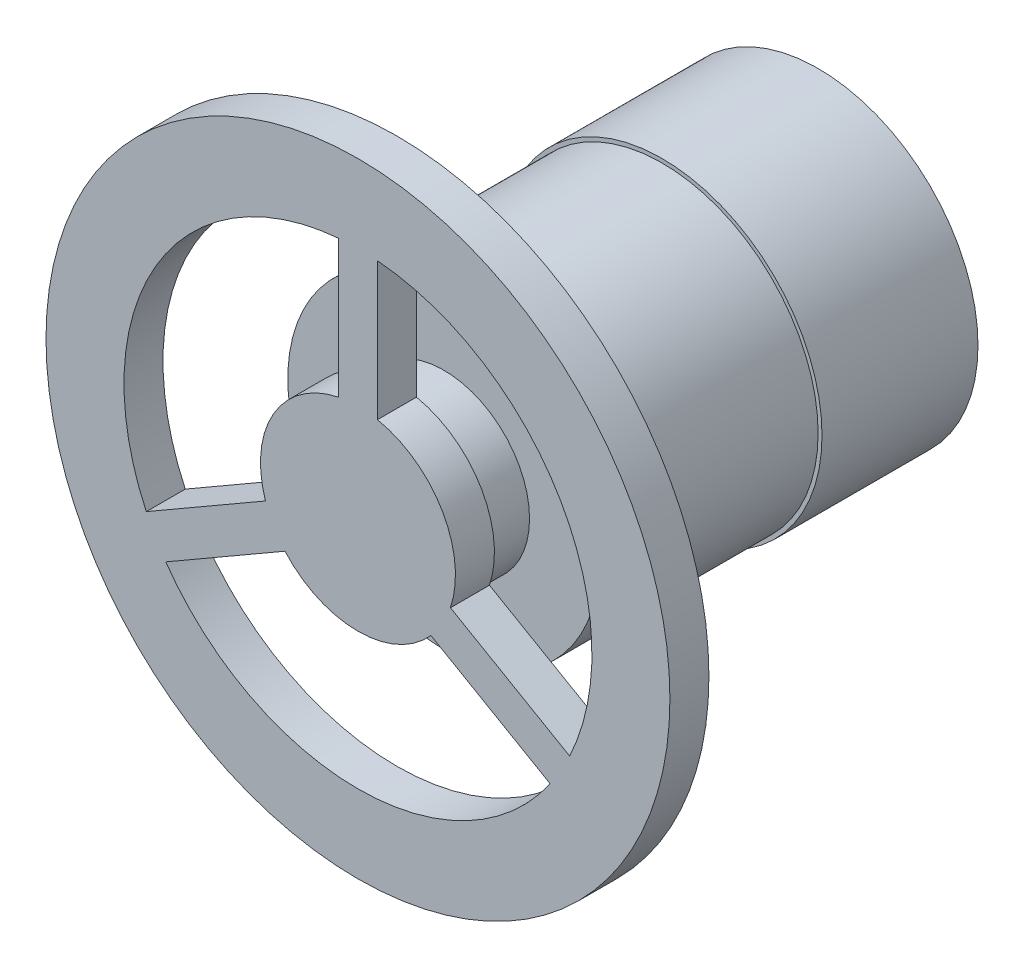
ISO-10303-21;
HEADER;
FILE_DESCRIPTION(('STEP AP214'),'2;1');
FILE_NAME('part.step','',(''),(''),'','','');
FILE_SCHEMA(('AUTOMOTIVE_DESIGN { 1 0 10303 214 1 1 1 1 }'));
ENDSEC;
DATA;
#1=APPLICATION_CONTEXT('core data for automotive mechanical design processes');
#2=APPLICATION_PROTOCOL_DEFINITION('international standard','automotive_design',2000,#1);
#3=PRODUCT_CONTEXT('',#1,'mechanical');
#4=PRODUCT('Part','Part','',(#3));
#5=PRODUCT_RELATED_PRODUCT_CATEGORY('part','',(#4));
#6=PRODUCT_DEFINITION_FORMATION('','',#4);
#7=PRODUCT_DEFINITION_CONTEXT('part definition',#1,'design');
#8=PRODUCT_DEFINITION('design','',#6,#7);
#9=PRODUCT_DEFINITION_SHAPE('','',#8);
#10=(LENGTH_UNIT() NAMED_UNIT(*) SI_UNIT(.MILLI.,.METRE.));
#11=(NAMED_UNIT(*) PLANE_ANGLE_UNIT() SI_UNIT($,.RADIAN.));
#12=(NAMED_UNIT(*) SI_UNIT($,.STERADIAN.) SOLID_ANGLE_UNIT());
#13=UNCERTAINTY_MEASURE_WITH_UNIT(LENGTH_MEASURE(1.E-05),#10,'distance_accuracy_value','');
#14=(GEOMETRIC_REPRESENTATION_CONTEXT(3) GLOBAL_UNCERTAINTY_ASSIGNED_CONTEXT((#13)) GLOBAL_UNIT_ASSIGNED_CONTEXT((#10,
#11,#12)) REPRESENTATION_CONTEXT('',''));
#15=CARTESIAN_POINT('',(0.,0.,0.));
#16=DIRECTION('',(0.,0.,1.));
#17=DIRECTION('',(1.,0.,0.));
#18=AXIS2_PLACEMENT_3D('',#15,#16,#17);
#19=CARTESIAN_POINT('',(0.,0.,20.));
#20=DIRECTION('',(0.,0.,-1.));
#21=DIRECTION('',(-1.,0.,0.));
#22=AXIS2_PLACEMENT_3D('',#19,#20,#21);
#23=CYLINDRICAL_SURFACE('',#22,20.5);
#24=CARTESIAN_POINT('',(0.,0.,20.));
#25=DIRECTION('',(0.,0.,1.));
#26=DIRECTION('',(1.,0.,0.));
#27=AXIS2_PLACEMENT_3D('',#24,#25,#26);
#28=CIRCLE('',#27,20.5);
#29=CARTESIAN_POINT('',(20.5,0.,20.));
#30=VERTEX_POINT('',#29);
#31=EDGE_CURVE('E235',#30,#30,#28,.T.);
#32=ORIENTED_EDGE('',*,*,#31,.F.);
#33=EDGE_LOOP('',(#32));
#34=FACE_BOUND('',#33,.T.);
#35=CARTESIAN_POINT('',(0.,0.,0.));
#36=DIRECTION('',(0.,0.,1.));
#37=DIRECTION('',(1.,0.,0.));
#38=AXIS2_PLACEMENT_3D('',#35,#36,#37);
#39=CIRCLE('',#38,20.5);
#40=CARTESIAN_POINT('',(20.5,0.,0.));
#41=VERTEX_POINT('',#40);
#42=EDGE_CURVE('E37',#41,#41,#39,.T.);
#43=ORIENTED_EDGE('',*,*,#42,.T.);
#44=EDGE_LOOP('',(#43));
#45=FACE_BOUND('',#44,.T.);
#46=ADVANCED_FACE('F34',(#34,#45),#23,.T.);
#47=CARTESIAN_POINT('',(0.,0.,20.));
#48=DIRECTION('',(0.,0.,1.));
#49=DIRECTION('',(1.,0.,0.));
#50=AXIS2_PLACEMENT_3D('',#47,#48,#49);
#51=PLANE('',#50);
#52=CARTESIAN_POINT('',(0.,0.,20.));
#53=DIRECTION('',(0.,0.,1.));
#54=DIRECTION('',(1.,0.,0.));
#55=AXIS2_PLACEMENT_3D('',#52,#53,#54);
#56=CIRCLE('',#55,20.);
#57=CARTESIAN_POINT('',(20.,0.,20.));
#58=VERTEX_POINT('',#57);
#59=EDGE_CURVE('E42',#58,#58,#56,.T.);
#60=ORIENTED_EDGE('',*,*,#59,.F.);
#61=EDGE_LOOP('',(#60));
#62=FACE_BOUND('',#61,.T.);
#63=ORIENTED_EDGE('',*,*,#31,.T.);
#64=EDGE_LOOP('',(#63));
#65=FACE_BOUND('',#64,.T.);
#66=ADVANCED_FACE('F246',(#62,#65),#51,.T.);
#67=CARTESIAN_POINT('',(0.,0.,0.));
#68=DIRECTION('',(0.,0.,1.));
#69=DIRECTION('',(1.,0.,0.));
#70=AXIS2_PLACEMENT_3D('',#67,#68,#69);
#71=PLANE('',#70);
#72=ORIENTED_EDGE('',*,*,#42,.F.);
#73=EDGE_LOOP('',(#72));
#74=FACE_BOUND('',#73,.T.);
#75=ADVANCED_FACE('F243',(#74),#71,.F.);
#76=CARTESIAN_POINT('',(0.,0.,48.));
#77=DIRECTION('',(0.,0.,-1.));
#78=DIRECTION('',(-1.,0.,0.));
#79=AXIS2_PLACEMENT_3D('',#76,#77,#78);
#80=CYLINDRICAL_SURFACE('',#79,20.);
#81=CARTESIAN_POINT('',(0.,0.,48.));
#82=DIRECTION('',(0.,0.,1.));
#83=DIRECTION('',(1.,0.,0.));
#84=AXIS2_PLACEMENT_3D('',#81,#82,#83);
#85=CIRCLE('',#84,20.);
#86=CARTESIAN_POINT('',(20.,0.,48.));
#87=VERTEX_POINT('',#86);
#88=EDGE_CURVE('E230',#87,#87,#85,.T.);
#89=ORIENTED_EDGE('',*,*,#88,.F.);
#90=EDGE_LOOP('',(#89));
#91=FACE_BOUND('',#90,.T.);
#92=ORIENTED_EDGE('',*,*,#59,.T.);
#93=EDGE_LOOP('',(#92));
#94=FACE_BOUND('',#93,.T.);
#95=ADVANCED_FACE('F245',(#91,#94),#80,.T.);
#96=CARTESIAN_POINT('',(0.,0.,48.));
#97=DIRECTION('',(0.,0.,1.));
#98=DIRECTION('',(1.,0.,0.));
#99=AXIS2_PLACEMENT_3D('',#96,#97,#98);
#100=PLANE('',#99);
#101=CARTESIAN_POINT('',(0.,0.,48.));
#102=DIRECTION('',(0.,0.,1.));
#103=DIRECTION('',(1.,0.,0.));
#104=AXIS2_PLACEMENT_3D('',#101,#102,#103);
#105=CIRCLE('',#104,11.);
#106=CARTESIAN_POINT('',(11.,0.,48.));
#107=VERTEX_POINT('',#106);
#108=EDGE_CURVE('E11',#107,#107,#105,.T.);
#109=ORIENTED_EDGE('',*,*,#108,.F.);
#110=EDGE_LOOP('',(#109));
#111=FACE_BOUND('',#110,.T.);
#112=ORIENTED_EDGE('',*,*,#88,.T.);
#113=EDGE_LOOP('',(#112));
#114=FACE_BOUND('',#113,.T.);
#115=ADVANCED_FACE('F251',(#111,#114),#100,.T.);
#116=CARTESIAN_POINT('',(0.,0.,54.));
#117=DIRECTION('',(0.,0.,-1.));
#118=DIRECTION('',(-1.,0.,0.));
#119=AXIS2_PLACEMENT_3D('',#116,#117,#118);
#120=CYLINDRICAL_SURFACE('',#119,11.);
#121=CARTESIAN_POINT('',(0.,0.,54.));
#122=DIRECTION('',(0.,0.,1.));
#123=DIRECTION('',(1.,0.,0.));
#124=AXIS2_PLACEMENT_3D('',#121,#122,#123);
#125=CIRCLE('',#124,11.);
#126=CARTESIAN_POINT('',(11.,0.,54.));
#127=VERTEX_POINT('',#126);
#128=EDGE_CURVE('E226',#127,#127,#125,.T.);
#129=ORIENTED_EDGE('',*,*,#128,.F.);
#130=EDGE_LOOP('',(#129));
#131=FACE_BOUND('',#130,.T.);
#132=ORIENTED_EDGE('',*,*,#108,.T.);
#133=EDGE_LOOP('',(#132));
#134=FACE_BOUND('',#133,.T.);
#135=ADVANCED_FACE('F281',(#131,#134),#120,.T.);
#136=CARTESIAN_POINT('',(0.,0.,59.));
#137=DIRECTION('',(0.,0.,1.));
#138=DIRECTION('',(1.,0.,0.));
#139=AXIS2_PLACEMENT_3D('',#136,#137,#138);
#140=PLANE('',#139);
#141=CARTESIAN_POINT('',(0.,0.,59.));
#142=DIRECTION('',(0.,0.,1.));
#143=DIRECTION('',(1.,0.,0.));
#144=AXIS2_PLACEMENT_3D('',#141,#142,#143);
#145=CIRCLE('',#144,40.);
#146=CARTESIAN_POINT('',(40.,0.,59.));
#147=VERTEX_POINT('',#146);
#148=EDGE_CURVE('E223',#147,#147,#145,.T.);
#149=ORIENTED_EDGE('',*,*,#148,.T.);
#150=EDGE_LOOP('',(#149));
#151=FACE_BOUND('',#150,.T.);
#152=DIRECTION('',(0.,-1.,0.));
#153=VECTOR('',#152,1.);
#154=CARTESIAN_POINT('',(2.50000000000012,12.2474487139159,59.));
#155=LINE('',#154,#153);
#156=CARTESIAN_POINT('',(2.50000000000013,29.8956518577535,59.));
#157=VERTEX_POINT('',#156);
#158=CARTESIAN_POINT('',(2.50000000000012,12.2474487139159,59.));
#159=VERTEX_POINT('',#158);
#160=EDGE_CURVE('E194',#157,#159,#155,.T.);
#161=ORIENTED_EDGE('',*,*,#160,.F.);
#162=CARTESIAN_POINT('',(0.,0.,59.));
#163=DIRECTION('',(0.,0.,1.));
#164=DIRECTION('',(1.,0.,0.));
#165=AXIS2_PLACEMENT_3D('',#162,#163,#164);
#166=CIRCLE('',#165,30.);
#167=CARTESIAN_POINT('',(27.1403939715103,-12.782762419415,59.));
#168=VERTEX_POINT('',#167);
#169=EDGE_CURVE('E192',#168,#157,#166,.T.);
#170=ORIENTED_EDGE('',*,*,#169,.F.);
#171=DIRECTION('',(0.866025403784437,-0.500000000000002,0.));
#172=VECTOR('',#171,1.);
#173=CARTESIAN_POINT('',(11.8566017177985,-3.95866084749609,59.));
#174=LINE('',#173,#172);
#175=CARTESIAN_POINT('',(11.8566017177985,-3.95866084749609,59.));
#176=VERTEX_POINT('',#175);
#177=EDGE_CURVE('E200',#176,#168,#174,.T.);
#178=ORIENTED_EDGE('',*,*,#177,.F.);
#179=CARTESIAN_POINT('',(0.,0.,59.));
#180=DIRECTION('',(0.,0.,-1.));
#181=DIRECTION('',(1.,0.,0.));
#182=AXIS2_PLACEMENT_3D('',#179,#180,#181);
#183=CIRCLE('',#182,12.5);
#184=EDGE_CURVE('E197',#159,#176,#183,.T.);
#185=ORIENTED_EDGE('',*,*,#184,.F.);
#186=EDGE_LOOP('',(#161,#170,#178,#185));
#187=FACE_BOUND('',#186,.T.);
#188=DIRECTION('',(0.866025403784443,0.499999999999992,0.));
#189=VECTOR('',#188,1.);
#190=CARTESIAN_POINT('',(-11.8566017177983,-3.95866084749674,59.));
#191=LINE('',#190,#189);
#192=CARTESIAN_POINT('',(-27.1403939715101,-12.7827624194154,59.));
#193=VERTEX_POINT('',#192);
#194=CARTESIAN_POINT('',(-11.8566017177983,-3.95866084749673,59.));
#195=VERTEX_POINT('',#194);
#196=EDGE_CURVE('E163',#193,#195,#191,.T.);
#197=ORIENTED_EDGE('',*,*,#196,.F.);
#198=CARTESIAN_POINT('',(0.,0.,59.));
#199=DIRECTION('',(0.,0.,1.));
#200=DIRECTION('',(1.,0.,0.));
#201=AXIS2_PLACEMENT_3D('',#198,#199,#200);
#202=CIRCLE('',#201,30.);
#203=CARTESIAN_POINT('',(-2.5,29.8956518577535,59.));
#204=VERTEX_POINT('',#203);
#205=EDGE_CURVE('E161',#204,#193,#202,.T.);
#206=ORIENTED_EDGE('',*,*,#205,.F.);
#207=DIRECTION('',(0.,1.,0.));
#208=VECTOR('',#207,1.);
#209=CARTESIAN_POINT('',(-2.5,12.2474487139159,59.));
#210=LINE('',#209,#208);
#211=CARTESIAN_POINT('',(-2.5,12.2474487139159,59.));
#212=VERTEX_POINT('',#211);
#213=EDGE_CURVE('E169',#212,#204,#210,.T.);
#214=ORIENTED_EDGE('',*,*,#213,.F.);
#215=CARTESIAN_POINT('',(0.,0.,59.));
#216=DIRECTION('',(0.,0.,-1.));
#217=DIRECTION('',(1.,0.,0.));
#218=AXIS2_PLACEMENT_3D('',#215,#216,#217);
#219=CIRCLE('',#218,12.5);
#220=EDGE_CURVE('E166',#195,#212,#219,.T.);
#221=ORIENTED_EDGE('',*,*,#220,.F.);
#222=EDGE_LOOP('',(#197,#206,#214,#221));
#223=FACE_BOUND('',#222,.T.);
#224=DIRECTION('',(-0.866025403784438,0.5,0.));
#225=VECTOR('',#224,1.);
#226=CARTESIAN_POINT('',(9.35660171779777,-8.28878786641955,59.));
#227=LINE('',#226,#225);
#228=CARTESIAN_POINT('',(24.6403939715096,-17.1128894383384,59.));
#229=VERTEX_POINT('',#228);
#230=CARTESIAN_POINT('',(9.35660171779777,-8.28878786641955,59.));
#231=VERTEX_POINT('',#230);
#232=EDGE_CURVE('E132',#229,#231,#227,.T.);
#233=ORIENTED_EDGE('',*,*,#232,.F.);
#234=CARTESIAN_POINT('',(0.,0.,59.));
#235=DIRECTION('',(0.,0.,1.));
#236=DIRECTION('',(1.,0.,0.));
#237=AXIS2_PLACEMENT_3D('',#234,#235,#236);
#238=CIRCLE('',#237,30.0000000000001);
#239=CARTESIAN_POINT('',(-24.6403939715096,-17.1128894383385,59.));
#240=VERTEX_POINT('',#239);
#241=EDGE_CURVE('E124',#240,#229,#238,.T.);
#242=ORIENTED_EDGE('',*,*,#241,.F.);
#243=DIRECTION('',(-0.866025403784441,-0.499999999999996,0.));
#244=VECTOR('',#243,1.);
#245=CARTESIAN_POINT('',(-9.35660171779789,-8.28878786641983,59.));
#246=LINE('',#245,#244);
#247=CARTESIAN_POINT('',(-9.35660171779778,-8.28878786641977,59.));
#248=VERTEX_POINT('',#247);
#249=EDGE_CURVE('E147',#248,#240,#246,.T.);
#250=ORIENTED_EDGE('',*,*,#249,.F.);
#251=CARTESIAN_POINT('',(0.,0.,59.));
#252=DIRECTION('',(0.,0.,-1.));
#253=DIRECTION('',(1.,0.,0.));
#254=AXIS2_PLACEMENT_3D('',#251,#252,#253);
#255=CIRCLE('',#254,12.5000000000001);
#256=EDGE_CURVE('E145',#231,#248,#255,.T.);
#257=ORIENTED_EDGE('',*,*,#256,.F.);
#258=EDGE_LOOP('',(#233,#242,#250,#257));
#259=FACE_BOUND('',#258,.T.);
#260=ADVANCED_FACE('F144',(#151,#187,#223,#259),#140,.T.);
#261=CARTESIAN_POINT('',(0.,0.,54.));
#262=DIRECTION('',(0.,0.,1.));
#263=DIRECTION('',(1.,0.,0.));
#264=AXIS2_PLACEMENT_3D('',#261,#262,#263);
#265=PLANE('',#264);
#266=ORIENTED_EDGE('',*,*,#128,.T.);
#267=EDGE_LOOP('',(#266));
#268=FACE_BOUND('',#267,.T.);
#269=CARTESIAN_POINT('',(0.,0.,54.));
#270=DIRECTION('',(0.,0.,1.));
#271=DIRECTION('',(1.,0.,0.));
#272=AXIS2_PLACEMENT_3D('',#269,#270,#271);
#273=CIRCLE('',#272,30.);
#274=CARTESIAN_POINT('',(-2.5,29.8956518577535,54.));
#275=VERTEX_POINT('',#274);
#276=CARTESIAN_POINT('',(-27.1403939715101,-12.7827624194154,54.));
#277=VERTEX_POINT('',#276);
#278=EDGE_CURVE('E140',#275,#277,#273,.T.);
#279=ORIENTED_EDGE('',*,*,#278,.T.);
#280=DIRECTION('',(0.866025403784443,0.499999999999992,0.));
#281=VECTOR('',#280,1.);
#282=CARTESIAN_POINT('',(-11.8566017177983,-3.95866084749674,54.));
#283=LINE('',#282,#281);
#284=CARTESIAN_POINT('',(-11.8566017177983,-3.95866084749673,54.));
#285=VERTEX_POINT('',#284);
#286=EDGE_CURVE('E174',#277,#285,#283,.T.);
#287=ORIENTED_EDGE('',*,*,#286,.T.);
#288=CARTESIAN_POINT('',(0.,0.,54.));
#289=DIRECTION('',(0.,0.,-1.));
#290=DIRECTION('',(1.,0.,0.));
#291=AXIS2_PLACEMENT_3D('',#288,#289,#290);
#292=CIRCLE('',#291,12.5);
#293=CARTESIAN_POINT('',(-2.5,12.2474487139159,54.));
#294=VERTEX_POINT('',#293);
#295=EDGE_CURVE('E177',#285,#294,#292,.T.);
#296=ORIENTED_EDGE('',*,*,#295,.T.);
#297=DIRECTION('',(0.,1.,0.));
#298=VECTOR('',#297,1.);
#299=CARTESIAN_POINT('',(-2.5,12.2474487139159,54.));
#300=LINE('',#299,#298);
#301=EDGE_CURVE('E164',#294,#275,#300,.T.);
#302=ORIENTED_EDGE('',*,*,#301,.T.);
#303=EDGE_LOOP('',(#279,#287,#296,#302));
#304=FACE_BOUND('',#303,.T.);
#305=CARTESIAN_POINT('',(0.,0.,54.));
#306=DIRECTION('',(0.,0.,1.));
#307=DIRECTION('',(1.,0.,0.));
#308=AXIS2_PLACEMENT_3D('',#305,#306,#307);
#309=CIRCLE('',#308,40.);
#310=CARTESIAN_POINT('',(40.,0.,54.));
#311=VERTEX_POINT('',#310);
#312=EDGE_CURVE('E222',#311,#311,#309,.T.);
#313=ORIENTED_EDGE('',*,*,#312,.F.);
#314=EDGE_LOOP('',(#313));
#315=FACE_BOUND('',#314,.T.);
#316=CARTESIAN_POINT('',(0.,0.,54.));
#317=DIRECTION('',(0.,0.,1.));
#318=DIRECTION('',(1.,0.,0.));
#319=AXIS2_PLACEMENT_3D('',#316,#317,#318);
#320=CIRCLE('',#319,30.);
#321=CARTESIAN_POINT('',(27.1403939715103,-12.782762419415,54.));
#322=VERTEX_POINT('',#321);
#323=CARTESIAN_POINT('',(2.50000000000013,29.8956518577535,54.));
#324=VERTEX_POINT('',#323);
#325=EDGE_CURVE('E191',#322,#324,#320,.T.);
#326=ORIENTED_EDGE('',*,*,#325,.T.);
#327=DIRECTION('',(0.,-1.,0.));
#328=VECTOR('',#327,1.);
#329=CARTESIAN_POINT('',(2.50000000000012,12.2474487139159,54.));
#330=LINE('',#329,#328);
#331=CARTESIAN_POINT('',(2.50000000000012,12.2474487139159,54.));
#332=VERTEX_POINT('',#331);
#333=EDGE_CURVE('E205',#324,#332,#330,.T.);
#334=ORIENTED_EDGE('',*,*,#333,.T.);
#335=CARTESIAN_POINT('',(0.,0.,54.));
#336=DIRECTION('',(0.,0.,-1.));
#337=DIRECTION('',(1.,0.,0.));
#338=AXIS2_PLACEMENT_3D('',#335,#336,#337);
#339=CIRCLE('',#338,12.5);
#340=CARTESIAN_POINT('',(11.8566017177985,-3.9586608474961,54.));
#341=VERTEX_POINT('',#340);
#342=EDGE_CURVE('E208',#332,#341,#339,.T.);
#343=ORIENTED_EDGE('',*,*,#342,.T.);
#344=DIRECTION('',(0.866025403784437,-0.500000000000002,0.));
#345=VECTOR('',#344,1.);
#346=CARTESIAN_POINT('',(11.8566017177985,-3.95866084749609,54.));
#347=LINE('',#346,#345);
#348=EDGE_CURVE('E195',#341,#322,#347,.T.);
#349=ORIENTED_EDGE('',*,*,#348,.T.);
#350=EDGE_LOOP('',(#326,#334,#343,#349));
#351=FACE_BOUND('',#350,.T.);
#352=CARTESIAN_POINT('',(0.,0.,54.));
#353=DIRECTION('',(0.,0.,1.));
#354=DIRECTION('',(1.,0.,0.));
#355=AXIS2_PLACEMENT_3D('',#352,#353,#354);
#356=CIRCLE('',#355,30.0000000000001);
#357=CARTESIAN_POINT('',(-24.6403939715096,-17.1128894383385,54.));
#358=VERTEX_POINT('',#357);
#359=CARTESIAN_POINT('',(24.6403939715096,-17.1128894383384,54.));
#360=VERTEX_POINT('',#359);
#361=EDGE_CURVE('E58',#358,#360,#356,.T.);
#362=ORIENTED_EDGE('',*,*,#361,.T.);
#363=DIRECTION('',(-0.866025403784438,0.5,0.));
#364=VECTOR('',#363,1.);
#365=CARTESIAN_POINT('',(9.35660171779777,-8.28878786641955,54.));
#366=LINE('',#365,#364);
#367=CARTESIAN_POINT('',(9.35660171779777,-8.28878786641955,54.));
#368=VERTEX_POINT('',#367);
#369=EDGE_CURVE('E139',#360,#368,#366,.T.);
#370=ORIENTED_EDGE('',*,*,#369,.T.);
#371=CARTESIAN_POINT('',(0.,0.,54.));
#372=DIRECTION('',(0.,0.,-1.));
#373=DIRECTION('',(1.,0.,0.));
#374=AXIS2_PLACEMENT_3D('',#371,#372,#373);
#375=CIRCLE('',#374,12.5000000000001);
#376=CARTESIAN_POINT('',(-9.35660171779778,-8.28878786641974,54.));
#377=VERTEX_POINT('',#376);
#378=EDGE_CURVE('E153',#368,#377,#375,.T.);
#379=ORIENTED_EDGE('',*,*,#378,.T.);
#380=DIRECTION('',(-0.866025403784441,-0.499999999999996,0.));
#381=VECTOR('',#380,1.);
#382=CARTESIAN_POINT('',(-9.35660171779789,-8.28878786641983,54.));
#383=LINE('',#382,#381);
#384=EDGE_CURVE('E133',#377,#358,#383,.T.);
#385=ORIENTED_EDGE('',*,*,#384,.T.);
#386=EDGE_LOOP('',(#362,#370,#379,#385));
#387=FACE_BOUND('',#386,.T.);
#388=ADVANCED_FACE('F300',(#268,#304,#315,#351,#387),#265,.F.);
#389=CARTESIAN_POINT('',(0.,0.,59.));
#390=DIRECTION('',(0.,0.,-1.));
#391=DIRECTION('',(-1.,0.,0.));
#392=AXIS2_PLACEMENT_3D('',#389,#390,#391);
#393=CYLINDRICAL_SURFACE('',#392,40.);
#394=ORIENTED_EDGE('',*,*,#148,.F.);
#395=EDGE_LOOP('',(#394));
#396=FACE_BOUND('',#395,.T.);
#397=ORIENTED_EDGE('',*,*,#312,.T.);
#398=EDGE_LOOP('',(#397));
#399=FACE_BOUND('',#398,.T.);
#400=ADVANCED_FACE('F310',(#396,#399),#393,.T.);
#401=CARTESIAN_POINT('',(0.,0.,59.));
#402=DIRECTION('',(0.,0.,-1.));
#403=DIRECTION('',(-1.,0.,0.));
#404=AXIS2_PLACEMENT_3D('',#401,#402,#403);
#405=CYLINDRICAL_SURFACE('',#404,30.);
#406=ORIENTED_EDGE('',*,*,#325,.F.);
#407=DIRECTION('',(0.,0.,-1.));
#408=VECTOR('',#407,1.);
#409=CARTESIAN_POINT('',(27.1403939715103,-12.782762419415,59.));
#410=LINE('',#409,#408);
#411=EDGE_CURVE('E202',#168,#322,#410,.T.);
#412=ORIENTED_EDGE('',*,*,#411,.F.);
#413=ORIENTED_EDGE('',*,*,#169,.T.);
#414=DIRECTION('',(0.,0.,-1.));
#415=VECTOR('',#414,1.);
#416=CARTESIAN_POINT('',(2.50000000000013,29.8956518577535,59.));
#417=LINE('',#416,#415);
#418=EDGE_CURVE('E219',#157,#324,#417,.T.);
#419=ORIENTED_EDGE('',*,*,#418,.T.);
#420=EDGE_LOOP('',(#406,#412,#413,#419));
#421=FACE_BOUND('',#420,.T.);
#422=ADVANCED_FACE('F320',(#421),#405,.F.);
#423=CARTESIAN_POINT('',(2.50000000000012,12.2474487139159,59.));
#424=DIRECTION('',(1.,0.,0.));
#425=DIRECTION('',(0.,1.,0.));
#426=AXIS2_PLACEMENT_3D('',#423,#424,#425);
#427=PLANE('',#426);
#428=ORIENTED_EDGE('',*,*,#333,.F.);
#429=ORIENTED_EDGE('',*,*,#418,.F.);
#430=ORIENTED_EDGE('',*,*,#160,.T.);
#431=DIRECTION('',(0.,0.,-1.));
#432=VECTOR('',#431,1.);
#433=CARTESIAN_POINT('',(2.50000000000012,12.2474487139159,59.));
#434=LINE('',#433,#432);
#435=EDGE_CURVE('E217',#159,#332,#434,.T.);
#436=ORIENTED_EDGE('',*,*,#435,.T.);
#437=EDGE_LOOP('',(#428,#429,#430,#436));
#438=FACE_BOUND('',#437,.T.);
#439=ADVANCED_FACE('F330',(#438),#427,.T.);
#440=CARTESIAN_POINT('',(0.,0.,59.));
#441=DIRECTION('',(0.,0.,-1.));
#442=DIRECTION('',(-1.,0.,0.));
#443=AXIS2_PLACEMENT_3D('',#440,#441,#442);
#444=CYLINDRICAL_SURFACE('',#443,12.5);
#445=ORIENTED_EDGE('',*,*,#342,.F.);
#446=ORIENTED_EDGE('',*,*,#435,.F.);
#447=ORIENTED_EDGE('',*,*,#184,.T.);
#448=DIRECTION('',(0.,0.,-1.));
#449=VECTOR('',#448,1.);
#450=CARTESIAN_POINT('',(11.8566017177985,-3.9586608474961,59.));
#451=LINE('',#450,#449);
#452=EDGE_CURVE('E215',#176,#341,#451,.T.);
#453=ORIENTED_EDGE('',*,*,#452,.T.);
#454=EDGE_LOOP('',(#445,#446,#447,#453));
#455=FACE_BOUND('',#454,.T.);
#456=ADVANCED_FACE('F340',(#455),#444,.T.);
#457=CARTESIAN_POINT('',(11.8566017177985,-3.95866084749609,59.));
#458=DIRECTION('',(0.500000000000002,0.866025403784437,0.));
#459=DIRECTION('',(-0.866025403784437,0.500000000000002,0.));
#460=AXIS2_PLACEMENT_3D('',#457,#458,#459);
#461=PLANE('',#460);
#462=ORIENTED_EDGE('',*,*,#348,.F.);
#463=ORIENTED_EDGE('',*,*,#452,.F.);
#464=ORIENTED_EDGE('',*,*,#177,.T.);
#465=ORIENTED_EDGE('',*,*,#411,.T.);
#466=EDGE_LOOP('',(#462,#463,#464,#465));
#467=FACE_BOUND('',#466,.T.);
#468=ADVANCED_FACE('F350',(#467),#461,.T.);
#469=CARTESIAN_POINT('',(0.,0.,59.));
#470=DIRECTION('',(0.,0.,-1.));
#471=DIRECTION('',(-1.,0.,0.));
#472=AXIS2_PLACEMENT_3D('',#469,#470,#471);
#473=CYLINDRICAL_SURFACE('',#472,30.);
#474=ORIENTED_EDGE('',*,*,#278,.F.);
#475=DIRECTION('',(0.,0.,-1.));
#476=VECTOR('',#475,1.);
#477=CARTESIAN_POINT('',(-2.5,29.8956518577535,59.));
#478=LINE('',#477,#476);
#479=EDGE_CURVE('E171',#204,#275,#478,.T.);
#480=ORIENTED_EDGE('',*,*,#479,.F.);
#481=ORIENTED_EDGE('',*,*,#205,.T.);
#482=DIRECTION('',(0.,0.,-1.));
#483=VECTOR('',#482,1.);
#484=CARTESIAN_POINT('',(-27.1403939715101,-12.7827624194154,59.));
#485=LINE('',#484,#483);
#486=EDGE_CURVE('E188',#193,#277,#485,.T.);
#487=ORIENTED_EDGE('',*,*,#486,.T.);
#488=EDGE_LOOP('',(#474,#480,#481,#487));
#489=FACE_BOUND('',#488,.T.);
#490=ADVANCED_FACE('F360',(#489),#473,.F.);
#491=CARTESIAN_POINT('',(-11.8566017177983,-3.95866084749674,59.));
#492=DIRECTION('',(-0.499999999999992,0.866025403784443,0.));
#493=DIRECTION('',(-0.866025403784443,-0.499999999999992,0.));
#494=AXIS2_PLACEMENT_3D('',#491,#492,#493);
#495=PLANE('',#494);
#496=ORIENTED_EDGE('',*,*,#286,.F.);
#497=ORIENTED_EDGE('',*,*,#486,.F.);
#498=ORIENTED_EDGE('',*,*,#196,.T.);
#499=DIRECTION('',(0.,0.,-1.));
#500=VECTOR('',#499,1.);
#501=CARTESIAN_POINT('',(-11.8566017177983,-3.95866084749673,59.));
#502=LINE('',#501,#500);
#503=EDGE_CURVE('E186',#195,#285,#502,.T.);
#504=ORIENTED_EDGE('',*,*,#503,.T.);
#505=EDGE_LOOP('',(#496,#497,#498,#504));
#506=FACE_BOUND('',#505,.T.);
#507=ADVANCED_FACE('F370',(#506),#495,.T.);
#508=CARTESIAN_POINT('',(0.,0.,59.));
#509=DIRECTION('',(0.,0.,-1.));
#510=DIRECTION('',(-1.,0.,0.));
#511=AXIS2_PLACEMENT_3D('',#508,#509,#510);
#512=CYLINDRICAL_SURFACE('',#511,12.5);
#513=ORIENTED_EDGE('',*,*,#295,.F.);
#514=ORIENTED_EDGE('',*,*,#503,.F.);
#515=ORIENTED_EDGE('',*,*,#220,.T.);
#516=DIRECTION('',(0.,0.,-1.));
#517=VECTOR('',#516,1.);
#518=CARTESIAN_POINT('',(-2.5,12.2474487139159,59.));
#519=LINE('',#518,#517);
#520=EDGE_CURVE('E184',#212,#294,#519,.T.);
#521=ORIENTED_EDGE('',*,*,#520,.T.);
#522=EDGE_LOOP('',(#513,#514,#515,#521));
#523=FACE_BOUND('',#522,.T.);
#524=ADVANCED_FACE('F380',(#523),#512,.T.);
#525=CARTESIAN_POINT('',(-2.5,12.2474487139159,59.));
#526=DIRECTION('',(-1.,0.,0.));
#527=DIRECTION('',(0.,0.,1.));
#528=AXIS2_PLACEMENT_3D('',#525,#526,#527);
#529=PLANE('',#528);
#530=ORIENTED_EDGE('',*,*,#301,.F.);
#531=ORIENTED_EDGE('',*,*,#520,.F.);
#532=ORIENTED_EDGE('',*,*,#213,.T.);
#533=ORIENTED_EDGE('',*,*,#479,.T.);
#534=EDGE_LOOP('',(#530,#531,#532,#533));
#535=FACE_BOUND('',#534,.T.);
#536=ADVANCED_FACE('F390',(#535),#529,.T.);
#537=CARTESIAN_POINT('',(0.,0.,59.));
#538=DIRECTION('',(0.,0.,-1.));
#539=DIRECTION('',(-1.,0.,0.));
#540=AXIS2_PLACEMENT_3D('',#537,#538,#539);
#541=CYLINDRICAL_SURFACE('',#540,30.0000000000001);
#542=ORIENTED_EDGE('',*,*,#361,.F.);
#543=DIRECTION('',(0.,0.,-1.));
#544=VECTOR('',#543,1.);
#545=CARTESIAN_POINT('',(-24.6403939715096,-17.1128894383385,59.));
#546=LINE('',#545,#544);
#547=EDGE_CURVE('E128',#240,#358,#546,.T.);
#548=ORIENTED_EDGE('',*,*,#547,.F.);
#549=ORIENTED_EDGE('',*,*,#241,.T.);
#550=DIRECTION('',(0.,0.,-1.));
#551=VECTOR('',#550,1.);
#552=CARTESIAN_POINT('',(24.6403939715096,-17.1128894383384,59.));
#553=LINE('',#552,#551);
#554=EDGE_CURVE('E127',#229,#360,#553,.T.);
#555=ORIENTED_EDGE('',*,*,#554,.T.);
#556=EDGE_LOOP('',(#542,#548,#549,#555));
#557=FACE_BOUND('',#556,.T.);
#558=ADVANCED_FACE('F126',(#557),#541,.F.);
#559=CARTESIAN_POINT('',(9.35660171779777,-8.28878786641955,59.));
#560=DIRECTION('',(-0.5,-0.866025403784439,0.));
#561=DIRECTION('',(0.866025403784439,-0.5,0.));
#562=AXIS2_PLACEMENT_3D('',#559,#560,#561);
#563=PLANE('',#562);
#564=ORIENTED_EDGE('',*,*,#369,.F.);
#565=ORIENTED_EDGE('',*,*,#554,.F.);
#566=ORIENTED_EDGE('',*,*,#232,.T.);
#567=DIRECTION('',(0.,0.,-1.));
#568=VECTOR('',#567,1.);
#569=CARTESIAN_POINT('',(9.35660171779777,-8.28878786641955,59.));
#570=LINE('',#569,#568);
#571=EDGE_CURVE('E141',#231,#368,#570,.T.);
#572=ORIENTED_EDGE('',*,*,#571,.T.);
#573=EDGE_LOOP('',(#564,#565,#566,#572));
#574=FACE_BOUND('',#573,.T.);
#575=ADVANCED_FACE('F136',(#574),#563,.T.);
#576=CARTESIAN_POINT('',(0.,0.,59.));
#577=DIRECTION('',(0.,0.,-1.));
#578=DIRECTION('',(-1.,0.,0.));
#579=AXIS2_PLACEMENT_3D('',#576,#577,#578);
#580=CYLINDRICAL_SURFACE('',#579,12.5000000000001);
#581=ORIENTED_EDGE('',*,*,#378,.F.);
#582=ORIENTED_EDGE('',*,*,#571,.F.);
#583=ORIENTED_EDGE('',*,*,#256,.T.);
#584=DIRECTION('',(0.,0.,-1.));
#585=VECTOR('',#584,1.);
#586=CARTESIAN_POINT('',(-9.35660171779778,-8.28878786641974,59.));
#587=LINE('',#586,#585);
#588=EDGE_CURVE('E50',#248,#377,#587,.T.);
#589=ORIENTED_EDGE('',*,*,#588,.T.);
#590=EDGE_LOOP('',(#581,#582,#583,#589));
#591=FACE_BOUND('',#590,.T.);
#592=ADVANCED_FACE('F417',(#591),#580,.T.);
#593=CARTESIAN_POINT('',(-9.35660171779789,-8.28878786641983,59.));
#594=DIRECTION('',(0.499999999999996,-0.866025403784441,0.));
#595=DIRECTION('',(0.866025403784441,0.499999999999996,0.));
#596=AXIS2_PLACEMENT_3D('',#593,#594,#595);
#597=PLANE('',#596);
#598=ORIENTED_EDGE('',*,*,#384,.F.);
#599=ORIENTED_EDGE('',*,*,#588,.F.);
#600=ORIENTED_EDGE('',*,*,#249,.T.);
#601=ORIENTED_EDGE('',*,*,#547,.T.);
#602=EDGE_LOOP('',(#598,#599,#600,#601));
#603=FACE_BOUND('',#602,.T.);
#604=ADVANCED_FACE('F426',(#603),#597,.T.);
#605=CLOSED_SHELL('',(#46,#66,#75,#95,#115,#135,#260,#388,#400,#422,#439,#456,#468,#490,#507,
#524,#536,#558,#575,#592,#604));
#606=MANIFOLD_SOLID_BREP('B2',#605);
#607=ADVANCED_BREP_SHAPE_REPRESENTATION('',(#18,#606),#14);
#608=SHAPE_DEFINITION_REPRESENTATION(#9,#607);
ENDSEC;
END-ISO-10303-21;
